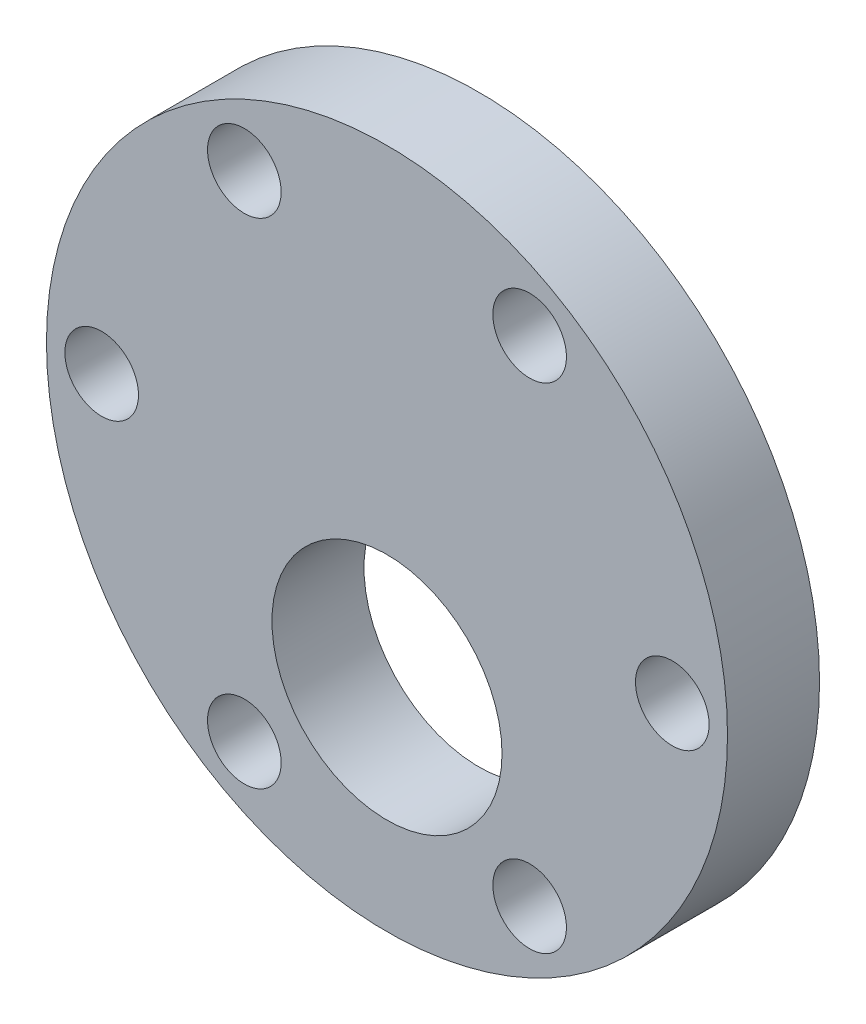
ISO-10303-21;
HEADER;
FILE_DESCRIPTION(('STEP AP214'),'2;1');
FILE_NAME('part.step','',(''),(''),'','','');
FILE_SCHEMA(('AUTOMOTIVE_DESIGN { 1 0 10303 214 1 1 1 1 }'));
ENDSEC;
DATA;
#1=APPLICATION_CONTEXT('core data for automotive mechanical design processes');
#2=APPLICATION_PROTOCOL_DEFINITION('international standard','automotive_design',2000,#1);
#3=PRODUCT_CONTEXT('',#1,'mechanical');
#4=PRODUCT('Part','Part','',(#3));
#5=PRODUCT_RELATED_PRODUCT_CATEGORY('part','',(#4));
#6=PRODUCT_DEFINITION_FORMATION('','',#4);
#7=PRODUCT_DEFINITION_CONTEXT('part definition',#1,'design');
#8=PRODUCT_DEFINITION('design','',#6,#7);
#9=PRODUCT_DEFINITION_SHAPE('','',#8);
#10=(LENGTH_UNIT() NAMED_UNIT(*) SI_UNIT(.MILLI.,.METRE.));
#11=(NAMED_UNIT(*) PLANE_ANGLE_UNIT() SI_UNIT($,.RADIAN.));
#12=(NAMED_UNIT(*) SI_UNIT($,.STERADIAN.) SOLID_ANGLE_UNIT());
#13=UNCERTAINTY_MEASURE_WITH_UNIT(LENGTH_MEASURE(1.E-05),#10,'distance_accuracy_value','');
#14=(GEOMETRIC_REPRESENTATION_CONTEXT(3) GLOBAL_UNCERTAINTY_ASSIGNED_CONTEXT((#13)) GLOBAL_UNIT_ASSIGNED_CONTEXT((#10,
#11,#12)) REPRESENTATION_CONTEXT('',''));
#15=CARTESIAN_POINT('',(0.,0.,0.));
#16=DIRECTION('',(0.,0.,1.));
#17=DIRECTION('',(1.,0.,0.));
#18=AXIS2_PLACEMENT_3D('',#15,#16,#17);
#19=CARTESIAN_POINT('',(0.,0.,5.));
#20=DIRECTION('',(0.,0.,-1.));
#21=DIRECTION('',(-1.,0.,0.));
#22=AXIS2_PLACEMENT_3D('',#19,#20,#21);
#23=CYLINDRICAL_SURFACE('',#22,18.5);
#24=CARTESIAN_POINT('',(0.,0.,5.));
#25=DIRECTION('',(0.,0.,1.));
#26=DIRECTION('',(1.,0.,0.));
#27=AXIS2_PLACEMENT_3D('',#24,#25,#26);
#28=CIRCLE('',#27,18.5);
#29=CARTESIAN_POINT('',(18.5,0.,5.));
#30=VERTEX_POINT('',#29);
#31=EDGE_CURVE('E10',#30,#30,#28,.T.);
#32=ORIENTED_EDGE('',*,*,#31,.F.);
#33=EDGE_LOOP('',(#32));
#34=FACE_BOUND('',#33,.T.);
#35=CARTESIAN_POINT('',(0.,0.,0.));
#36=DIRECTION('',(0.,0.,1.));
#37=DIRECTION('',(1.,0.,0.));
#38=AXIS2_PLACEMENT_3D('',#35,#36,#37);
#39=CIRCLE('',#38,18.5);
#40=CARTESIAN_POINT('',(18.5,0.,0.));
#41=VERTEX_POINT('',#40);
#42=EDGE_CURVE('E34',#41,#41,#39,.T.);
#43=ORIENTED_EDGE('',*,*,#42,.T.);
#44=EDGE_LOOP('',(#43));
#45=FACE_BOUND('',#44,.T.);
#46=ADVANCED_FACE('F31',(#34,#45),#23,.T.);
#47=CARTESIAN_POINT('',(0.,0.,5.));
#48=DIRECTION('',(0.,0.,1.));
#49=DIRECTION('',(1.,0.,0.));
#50=AXIS2_PLACEMENT_3D('',#47,#48,#49);
#51=PLANE('',#50);
#52=CARTESIAN_POINT('',(0.,-7.,5.));
#53=DIRECTION('',(0.,0.,1.));
#54=DIRECTION('',(1.,0.,0.));
#55=AXIS2_PLACEMENT_3D('',#52,#53,#54);
#56=CIRCLE('',#55,6.25);
#57=CARTESIAN_POINT('',(6.25,-7.,5.));
#58=VERTEX_POINT('',#57);
#59=EDGE_CURVE('E79',#58,#58,#56,.T.);
#60=ORIENTED_EDGE('',*,*,#59,.F.);
#61=EDGE_LOOP('',(#60));
#62=FACE_BOUND('',#61,.T.);
#63=CARTESIAN_POINT('',(-15.5,0.,5.));
#64=DIRECTION('',(0.,0.,1.));
#65=DIRECTION('',(1.,0.,0.));
#66=AXIS2_PLACEMENT_3D('',#63,#64,#65);
#67=CIRCLE('',#66,2.);
#68=CARTESIAN_POINT('',(-13.5,0.,5.));
#69=VERTEX_POINT('',#68);
#70=EDGE_CURVE('E49',#69,#69,#67,.T.);
#71=ORIENTED_EDGE('',*,*,#70,.F.);
#72=EDGE_LOOP('',(#71));
#73=FACE_BOUND('',#72,.T.);
#74=CARTESIAN_POINT('',(-7.75000000000006,-13.4233937586588,5.));
#75=DIRECTION('',(0.,0.,1.));
#76=DIRECTION('',(1.,0.,0.));
#77=AXIS2_PLACEMENT_3D('',#74,#75,#76);
#78=CIRCLE('',#77,2.);
#79=CARTESIAN_POINT('',(-5.75000000000006,-13.4233937586588,5.));
#80=VERTEX_POINT('',#79);
#81=EDGE_CURVE('E56',#80,#80,#78,.T.);
#82=ORIENTED_EDGE('',*,*,#81,.F.);
#83=EDGE_LOOP('',(#82));
#84=FACE_BOUND('',#83,.T.);
#85=CARTESIAN_POINT('',(7.74999999999997,-13.4233937586588,5.));
#86=DIRECTION('',(0.,0.,1.));
#87=DIRECTION('',(1.,0.,0.));
#88=AXIS2_PLACEMENT_3D('',#85,#86,#87);
#89=CIRCLE('',#88,2.);
#90=CARTESIAN_POINT('',(9.74999999999997,-13.4233937586588,5.));
#91=VERTEX_POINT('',#90);
#92=EDGE_CURVE('E62',#91,#91,#89,.T.);
#93=ORIENTED_EDGE('',*,*,#92,.F.);
#94=EDGE_LOOP('',(#93));
#95=FACE_BOUND('',#94,.T.);
#96=CARTESIAN_POINT('',(15.5,0.,5.));
#97=DIRECTION('',(0.,0.,1.));
#98=DIRECTION('',(1.,0.,0.));
#99=AXIS2_PLACEMENT_3D('',#96,#97,#98);
#100=CIRCLE('',#99,2.);
#101=CARTESIAN_POINT('',(17.5,0.,5.));
#102=VERTEX_POINT('',#101);
#103=EDGE_CURVE('E68',#102,#102,#100,.T.);
#104=ORIENTED_EDGE('',*,*,#103,.F.);
#105=EDGE_LOOP('',(#104));
#106=FACE_BOUND('',#105,.T.);
#107=CARTESIAN_POINT('',(7.75000000000016,13.4233937586587,5.));
#108=DIRECTION('',(0.,0.,1.));
#109=DIRECTION('',(1.,0.,0.));
#110=AXIS2_PLACEMENT_3D('',#107,#108,#109);
#111=CIRCLE('',#110,2.);
#112=CARTESIAN_POINT('',(9.75000000000016,13.4233937586587,5.));
#113=VERTEX_POINT('',#112);
#114=EDGE_CURVE('E74',#113,#113,#111,.T.);
#115=ORIENTED_EDGE('',*,*,#114,.F.);
#116=EDGE_LOOP('',(#115));
#117=FACE_BOUND('',#116,.T.);
#118=CARTESIAN_POINT('',(-7.74999999999987,13.4233937586589,5.));
#119=DIRECTION('',(0.,0.,1.));
#120=DIRECTION('',(1.,0.,0.));
#121=AXIS2_PLACEMENT_3D('',#118,#119,#120);
#122=CIRCLE('',#121,2.);
#123=CARTESIAN_POINT('',(-5.74999999999987,13.4233937586589,5.));
#124=VERTEX_POINT('',#123);
#125=EDGE_CURVE('E43',#124,#124,#122,.T.);
#126=ORIENTED_EDGE('',*,*,#125,.F.);
#127=EDGE_LOOP('',(#126));
#128=FACE_BOUND('',#127,.T.);
#129=ORIENTED_EDGE('',*,*,#31,.T.);
#130=EDGE_LOOP('',(#129));
#131=FACE_BOUND('',#130,.T.);
#132=ADVANCED_FACE('F95',(#62,#73,#84,#95,#106,#117,#128,#131),#51,.T.);
#133=CARTESIAN_POINT('',(0.,0.,0.));
#134=DIRECTION('',(0.,0.,1.));
#135=DIRECTION('',(1.,0.,0.));
#136=AXIS2_PLACEMENT_3D('',#133,#134,#135);
#137=PLANE('',#136);
#138=CARTESIAN_POINT('',(0.,-7.,0.));
#139=DIRECTION('',(0.,0.,1.));
#140=DIRECTION('',(1.,0.,0.));
#141=AXIS2_PLACEMENT_3D('',#138,#139,#140);
#142=CIRCLE('',#141,6.25);
#143=CARTESIAN_POINT('',(6.25,-7.,0.));
#144=VERTEX_POINT('',#143);
#145=EDGE_CURVE('E53',#144,#144,#142,.T.);
#146=ORIENTED_EDGE('',*,*,#145,.T.);
#147=EDGE_LOOP('',(#146));
#148=FACE_BOUND('',#147,.T.);
#149=CARTESIAN_POINT('',(-15.5,0.,0.));
#150=DIRECTION('',(0.,0.,1.));
#151=DIRECTION('',(1.,0.,0.));
#152=AXIS2_PLACEMENT_3D('',#149,#150,#151);
#153=CIRCLE('',#152,2.);
#154=CARTESIAN_POINT('',(-13.5,0.,0.));
#155=VERTEX_POINT('',#154);
#156=EDGE_CURVE('E52',#155,#155,#153,.T.);
#157=ORIENTED_EDGE('',*,*,#156,.T.);
#158=EDGE_LOOP('',(#157));
#159=FACE_BOUND('',#158,.T.);
#160=CARTESIAN_POINT('',(-7.75000000000006,-13.4233937586588,0.));
#161=DIRECTION('',(0.,0.,1.));
#162=DIRECTION('',(1.,0.,0.));
#163=AXIS2_PLACEMENT_3D('',#160,#161,#162);
#164=CIRCLE('',#163,2.);
#165=CARTESIAN_POINT('',(-5.75000000000006,-13.4233937586588,0.));
#166=VERTEX_POINT('',#165);
#167=EDGE_CURVE('E59',#166,#166,#164,.T.);
#168=ORIENTED_EDGE('',*,*,#167,.T.);
#169=EDGE_LOOP('',(#168));
#170=FACE_BOUND('',#169,.T.);
#171=CARTESIAN_POINT('',(7.74999999999997,-13.4233937586588,0.));
#172=DIRECTION('',(0.,0.,1.));
#173=DIRECTION('',(1.,0.,0.));
#174=AXIS2_PLACEMENT_3D('',#171,#172,#173);
#175=CIRCLE('',#174,2.);
#176=CARTESIAN_POINT('',(9.74999999999997,-13.4233937586588,0.));
#177=VERTEX_POINT('',#176);
#178=EDGE_CURVE('E65',#177,#177,#175,.T.);
#179=ORIENTED_EDGE('',*,*,#178,.T.);
#180=EDGE_LOOP('',(#179));
#181=FACE_BOUND('',#180,.T.);
#182=CARTESIAN_POINT('',(15.5,0.,0.));
#183=DIRECTION('',(0.,0.,1.));
#184=DIRECTION('',(1.,0.,0.));
#185=AXIS2_PLACEMENT_3D('',#182,#183,#184);
#186=CIRCLE('',#185,2.);
#187=CARTESIAN_POINT('',(17.5,0.,0.));
#188=VERTEX_POINT('',#187);
#189=EDGE_CURVE('E71',#188,#188,#186,.T.);
#190=ORIENTED_EDGE('',*,*,#189,.T.);
#191=EDGE_LOOP('',(#190));
#192=FACE_BOUND('',#191,.T.);
#193=CARTESIAN_POINT('',(7.75000000000016,13.4233937586587,0.));
#194=DIRECTION('',(0.,0.,1.));
#195=DIRECTION('',(1.,0.,0.));
#196=AXIS2_PLACEMENT_3D('',#193,#194,#195);
#197=CIRCLE('',#196,2.);
#198=CARTESIAN_POINT('',(9.75000000000016,13.4233937586587,0.));
#199=VERTEX_POINT('',#198);
#200=EDGE_CURVE('E46',#199,#199,#197,.T.);
#201=ORIENTED_EDGE('',*,*,#200,.T.);
#202=EDGE_LOOP('',(#201));
#203=FACE_BOUND('',#202,.T.);
#204=CARTESIAN_POINT('',(-7.74999999999987,13.4233937586589,0.));
#205=DIRECTION('',(0.,0.,1.));
#206=DIRECTION('',(1.,0.,0.));
#207=AXIS2_PLACEMENT_3D('',#204,#205,#206);
#208=CIRCLE('',#207,2.);
#209=CARTESIAN_POINT('',(-5.74999999999987,13.4233937586589,0.));
#210=VERTEX_POINT('',#209);
#211=EDGE_CURVE('E41',#210,#210,#208,.T.);
#212=ORIENTED_EDGE('',*,*,#211,.T.);
#213=EDGE_LOOP('',(#212));
#214=FACE_BOUND('',#213,.T.);
#215=ORIENTED_EDGE('',*,*,#42,.F.);
#216=EDGE_LOOP('',(#215));
#217=FACE_BOUND('',#216,.T.);
#218=ADVANCED_FACE('F85',(#148,#159,#170,#181,#192,#203,#214,#217),#137,.F.);
#219=CARTESIAN_POINT('',(-7.74999999999987,13.4233937586589,0.));
#220=DIRECTION('',(0.,0.,1.));
#221=DIRECTION('',(1.,0.,0.));
#222=AXIS2_PLACEMENT_3D('',#219,#220,#221);
#223=CYLINDRICAL_SURFACE('',#222,2.);
#224=ORIENTED_EDGE('',*,*,#211,.F.);
#225=EDGE_LOOP('',(#224));
#226=FACE_BOUND('',#225,.T.);
#227=ORIENTED_EDGE('',*,*,#125,.T.);
#228=EDGE_LOOP('',(#227));
#229=FACE_BOUND('',#228,.T.);
#230=ADVANCED_FACE('F111',(#226,#229),#223,.F.);
#231=CARTESIAN_POINT('',(7.75000000000016,13.4233937586587,0.));
#232=DIRECTION('',(0.,0.,1.));
#233=DIRECTION('',(1.,0.,0.));
#234=AXIS2_PLACEMENT_3D('',#231,#232,#233);
#235=CYLINDRICAL_SURFACE('',#234,2.);
#236=ORIENTED_EDGE('',*,*,#200,.F.);
#237=EDGE_LOOP('',(#236));
#238=FACE_BOUND('',#237,.T.);
#239=ORIENTED_EDGE('',*,*,#114,.T.);
#240=EDGE_LOOP('',(#239));
#241=FACE_BOUND('',#240,.T.);
#242=ADVANCED_FACE('F113',(#238,#241),#235,.F.);
#243=CARTESIAN_POINT('',(15.5,0.,0.));
#244=DIRECTION('',(0.,0.,1.));
#245=DIRECTION('',(1.,0.,0.));
#246=AXIS2_PLACEMENT_3D('',#243,#244,#245);
#247=CYLINDRICAL_SURFACE('',#246,2.);
#248=ORIENTED_EDGE('',*,*,#189,.F.);
#249=EDGE_LOOP('',(#248));
#250=FACE_BOUND('',#249,.T.);
#251=ORIENTED_EDGE('',*,*,#103,.T.);
#252=EDGE_LOOP('',(#251));
#253=FACE_BOUND('',#252,.T.);
#254=ADVANCED_FACE('F120',(#250,#253),#247,.F.);
#255=CARTESIAN_POINT('',(7.74999999999997,-13.4233937586588,0.));
#256=DIRECTION('',(0.,0.,1.));
#257=DIRECTION('',(1.,0.,0.));
#258=AXIS2_PLACEMENT_3D('',#255,#256,#257);
#259=CYLINDRICAL_SURFACE('',#258,2.);
#260=ORIENTED_EDGE('',*,*,#178,.F.);
#261=EDGE_LOOP('',(#260));
#262=FACE_BOUND('',#261,.T.);
#263=ORIENTED_EDGE('',*,*,#92,.T.);
#264=EDGE_LOOP('',(#263));
#265=FACE_BOUND('',#264,.T.);
#266=ADVANCED_FACE('F162',(#262,#265),#259,.F.);
#267=CARTESIAN_POINT('',(-7.75000000000006,-13.4233937586588,0.));
#268=DIRECTION('',(0.,0.,1.));
#269=DIRECTION('',(1.,0.,0.));
#270=AXIS2_PLACEMENT_3D('',#267,#268,#269);
#271=CYLINDRICAL_SURFACE('',#270,2.);
#272=ORIENTED_EDGE('',*,*,#167,.F.);
#273=EDGE_LOOP('',(#272));
#274=FACE_BOUND('',#273,.T.);
#275=ORIENTED_EDGE('',*,*,#81,.T.);
#276=EDGE_LOOP('',(#275));
#277=FACE_BOUND('',#276,.T.);
#278=ADVANCED_FACE('F156',(#274,#277),#271,.F.);
#279=CARTESIAN_POINT('',(-15.5,0.,0.));
#280=DIRECTION('',(0.,0.,1.));
#281=DIRECTION('',(1.,0.,0.));
#282=AXIS2_PLACEMENT_3D('',#279,#280,#281);
#283=CYLINDRICAL_SURFACE('',#282,2.);
#284=ORIENTED_EDGE('',*,*,#156,.F.);
#285=EDGE_LOOP('',(#284));
#286=FACE_BOUND('',#285,.T.);
#287=ORIENTED_EDGE('',*,*,#70,.T.);
#288=EDGE_LOOP('',(#287));
#289=FACE_BOUND('',#288,.T.);
#290=ADVANCED_FACE('F91',(#286,#289),#283,.F.);
#291=CARTESIAN_POINT('',(0.,-7.,0.));
#292=DIRECTION('',(0.,0.,1.));
#293=DIRECTION('',(1.,0.,0.));
#294=AXIS2_PLACEMENT_3D('',#291,#292,#293);
#295=CYLINDRICAL_SURFACE('',#294,6.25);
#296=ORIENTED_EDGE('',*,*,#145,.F.);
#297=EDGE_LOOP('',(#296));
#298=FACE_BOUND('',#297,.T.);
#299=ORIENTED_EDGE('',*,*,#59,.T.);
#300=EDGE_LOOP('',(#299));
#301=FACE_BOUND('',#300,.T.);
#302=ADVANCED_FACE('F88',(#298,#301),#295,.F.);
#303=CLOSED_SHELL('',(#46,#132,#218,#230,#242,#254,#266,#278,#290,#302));
#304=MANIFOLD_SOLID_BREP('B2',#303);
#305=ADVANCED_BREP_SHAPE_REPRESENTATION('',(#18,#304),#14);
#306=SHAPE_DEFINITION_REPRESENTATION(#9,#305);
ENDSEC;
END-ISO-10303-21;
